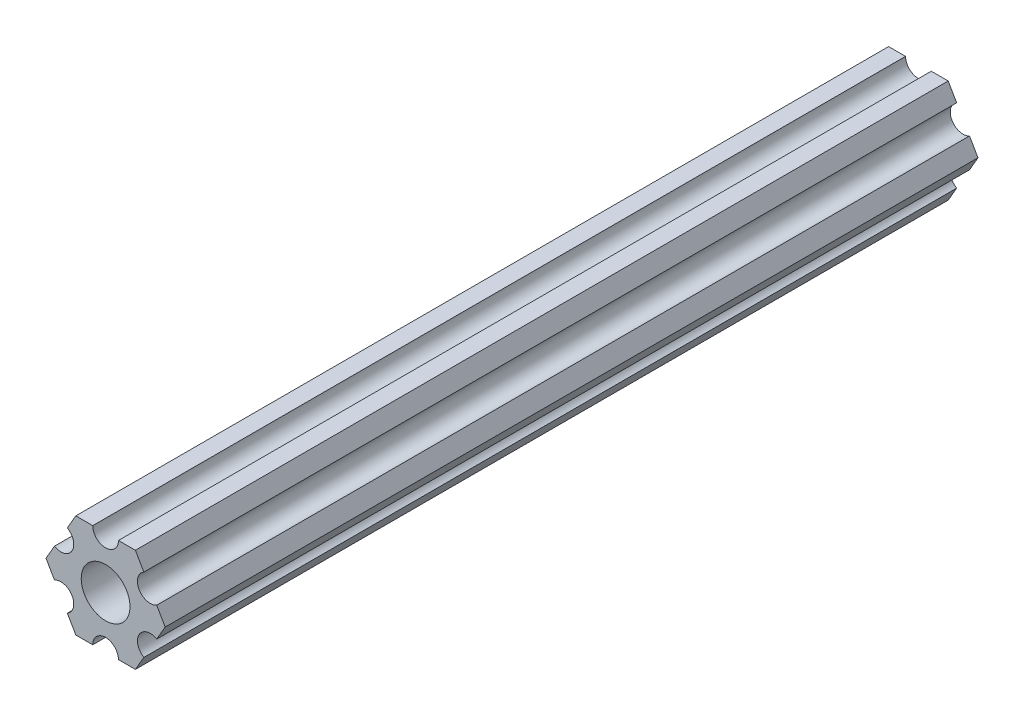
ISO-10303-21;
HEADER;
FILE_DESCRIPTION(('STEP AP214'),'2;1');
FILE_NAME('part.step','',(''),(''),'','','');
FILE_SCHEMA(('AUTOMOTIVE_DESIGN { 1 0 10303 214 1 1 1 1 }'));
ENDSEC;
DATA;
#1=APPLICATION_CONTEXT('core data for automotive mechanical design processes');
#2=APPLICATION_PROTOCOL_DEFINITION('international standard','automotive_design',2000,#1);
#3=PRODUCT_CONTEXT('',#1,'mechanical');
#4=PRODUCT('Part','Part','',(#3));
#5=PRODUCT_RELATED_PRODUCT_CATEGORY('part','',(#4));
#6=PRODUCT_DEFINITION_FORMATION('','',#4);
#7=PRODUCT_DEFINITION_CONTEXT('part definition',#1,'design');
#8=PRODUCT_DEFINITION('design','',#6,#7);
#9=PRODUCT_DEFINITION_SHAPE('','',#8);
#10=(LENGTH_UNIT() NAMED_UNIT(*) SI_UNIT(.MILLI.,.METRE.));
#11=(NAMED_UNIT(*) PLANE_ANGLE_UNIT() SI_UNIT($,.RADIAN.));
#12=(NAMED_UNIT(*) SI_UNIT($,.STERADIAN.) SOLID_ANGLE_UNIT());
#13=UNCERTAINTY_MEASURE_WITH_UNIT(LENGTH_MEASURE(1.E-05),#10,'distance_accuracy_value','');
#14=(GEOMETRIC_REPRESENTATION_CONTEXT(3) GLOBAL_UNCERTAINTY_ASSIGNED_CONTEXT((#13)) GLOBAL_UNIT_ASSIGNED_CONTEXT((#10,
#11,#12)) REPRESENTATION_CONTEXT('',''));
#15=CARTESIAN_POINT('',(0.,0.,0.));
#16=DIRECTION('',(0.,0.,1.));
#17=DIRECTION('',(1.,0.,0.));
#18=AXIS2_PLACEMENT_3D('',#15,#16,#17);
#19=CARTESIAN_POINT('',(7.3323484187082,0.,100.));
#20=DIRECTION('',(0.866025434075722,-0.499999947533954,0.));
#21=DIRECTION('',(0.499999947533954,0.866025434075722,0.));
#22=AXIS2_PLACEMENT_3D('',#19,#20,#21);
#23=PLANE('',#22);
#24=DIRECTION('',(-0.499999947533954,-0.866025434075722,0.));
#25=VECTOR('',#24,1.);
#26=CARTESIAN_POINT('',(7.3323484187082,0.,0.));
#27=LINE('',#26,#25);
#28=CARTESIAN_POINT('',(7.3323484187082,0.,0.));
#29=VERTEX_POINT('',#28);
#30=CARTESIAN_POINT('',(6.28987187503631,-1.80562259196218,0.));
#31=VERTEX_POINT('',#30);
#32=EDGE_CURVE('E197',#29,#31,#27,.T.);
#33=ORIENTED_EDGE('',*,*,#32,.F.);
#34=DIRECTION('',(0.,0.,-1.));
#35=VECTOR('',#34,1.);
#36=CARTESIAN_POINT('',(7.3323484187082,0.,100.));
#37=LINE('',#36,#35);
#38=CARTESIAN_POINT('',(7.3323484187082,0.,100.));
#39=VERTEX_POINT('',#38);
#40=EDGE_CURVE('E11',#39,#29,#37,.T.);
#41=ORIENTED_EDGE('',*,*,#40,.F.);
#42=DIRECTION('',(-0.499999947533954,-0.866025434075722,0.));
#43=VECTOR('',#42,1.);
#44=CARTESIAN_POINT('',(7.3323484187082,0.,100.));
#45=LINE('',#44,#43);
#46=CARTESIAN_POINT('',(6.28987187503631,-1.80562259196218,100.));
#47=VERTEX_POINT('',#46);
#48=EDGE_CURVE('E248',#39,#47,#45,.T.);
#49=ORIENTED_EDGE('',*,*,#48,.T.);
#50=DIRECTION('',(0.,0.,-1.));
#51=VECTOR('',#50,1.);
#52=CARTESIAN_POINT('',(6.28987187503631,-1.80562259196218,100.));
#53=LINE('',#52,#51);
#54=EDGE_CURVE('E43',#47,#31,#53,.T.);
#55=ORIENTED_EDGE('',*,*,#54,.T.);
#56=EDGE_LOOP('',(#33,#41,#49,#55));
#57=FACE_BOUND('',#56,.T.);
#58=ADVANCED_FACE('F40',(#57),#23,.T.);
#59=CARTESIAN_POINT('',(6.28987127155853,1.80562313196892,100.));
#60=DIRECTION('',(0.866025373493151,0.500000052466046,0.));
#61=DIRECTION('',(-0.500000052466046,0.866025373493151,0.));
#62=AXIS2_PLACEMENT_3D('',#59,#60,#61);
#63=PLANE('',#62);
#64=DIRECTION('',(0.500000052466046,-0.866025373493151,0.));
#65=VECTOR('',#64,1.);
#66=CARTESIAN_POINT('',(6.28987127155853,1.80562313196892,0.));
#67=LINE('',#66,#65);
#68=CARTESIAN_POINT('',(6.28987127155855,1.80562313196887,0.));
#69=VERTEX_POINT('',#68);
#70=EDGE_CURVE('E246',#69,#29,#67,.T.);
#71=ORIENTED_EDGE('',*,*,#70,.F.);
#72=DIRECTION('',(0.,0.,-1.));
#73=VECTOR('',#72,1.);
#74=CARTESIAN_POINT('',(6.28987127155855,1.80562313196887,100.));
#75=LINE('',#74,#73);
#76=CARTESIAN_POINT('',(6.28987127155855,1.80562313196887,100.));
#77=VERTEX_POINT('',#76);
#78=EDGE_CURVE('E49',#77,#69,#75,.T.);
#79=ORIENTED_EDGE('',*,*,#78,.F.);
#80=DIRECTION('',(0.500000052466046,-0.866025373493151,0.));
#81=VECTOR('',#80,1.);
#82=CARTESIAN_POINT('',(6.28987127155853,1.80562313196892,100.));
#83=LINE('',#82,#81);
#84=EDGE_CURVE('E187',#77,#39,#83,.T.);
#85=ORIENTED_EDGE('',*,*,#84,.T.);
#86=ORIENTED_EDGE('',*,*,#40,.T.);
#87=EDGE_LOOP('',(#71,#79,#85,#86));
#88=FACE_BOUND('',#87,.T.);
#89=ADVANCED_FACE('F280',(#88),#63,.T.);
#90=CARTESIAN_POINT('',(5.49926112168159,3.17500033315928,100.));
#91=DIRECTION('',(0.,0.,-1.));
#92=DIRECTION('',(-1.,0.,0.));
#93=AXIS2_PLACEMENT_3D('',#90,#91,#92);
#94=CYLINDRICAL_SURFACE('',#93,1.58122051853262);
#95=CARTESIAN_POINT('',(5.49926112168159,3.17500033315928,0.));
#96=DIRECTION('',(0.,0.,1.));
#97=DIRECTION('',(1.,0.,0.));
#98=AXIS2_PLACEMENT_3D('',#95,#96,#97);
#99=CIRCLE('',#98,1.58122051853262);
#100=CARTESIAN_POINT('',(4.70865058710515,4.54437731224338,0.));
#101=VERTEX_POINT('',#100);
#102=EDGE_CURVE('E174',#101,#69,#99,.T.);
#103=ORIENTED_EDGE('',*,*,#102,.F.);
#104=DIRECTION('',(0.,0.,-1.));
#105=VECTOR('',#104,1.);
#106=CARTESIAN_POINT('',(4.70865058710515,4.54437731224338,100.));
#107=LINE('',#106,#105);
#108=CARTESIAN_POINT('',(4.70865058710515,4.54437731224338,100.));
#109=VERTEX_POINT('',#108);
#110=EDGE_CURVE('E169',#109,#101,#107,.T.);
#111=ORIENTED_EDGE('',*,*,#110,.F.);
#112=CARTESIAN_POINT('',(5.49926112168159,3.17500033315928,100.));
#113=DIRECTION('',(0.,0.,1.));
#114=DIRECTION('',(1.,0.,0.));
#115=AXIS2_PLACEMENT_3D('',#112,#113,#114);
#116=CIRCLE('',#115,1.58122051853262);
#117=EDGE_CURVE('E172',#109,#77,#116,.T.);
#118=ORIENTED_EDGE('',*,*,#117,.T.);
#119=ORIENTED_EDGE('',*,*,#78,.T.);
#120=EDGE_LOOP('',(#103,#111,#118,#119));
#121=FACE_BOUND('',#120,.T.);
#122=ADVANCED_FACE('F171',(#121),#94,.F.);
#123=CARTESIAN_POINT('',(3.66617382465476,6.3499997778937,100.));
#124=DIRECTION('',(0.866025373493151,0.500000052466046,0.));
#125=DIRECTION('',(-0.500000052466046,0.866025373493151,0.));
#126=AXIS2_PLACEMENT_3D('',#123,#124,#125);
#127=PLANE('',#126);
#128=DIRECTION('',(0.500000052466046,-0.866025373493151,0.));
#129=VECTOR('',#128,1.);
#130=CARTESIAN_POINT('',(3.66617382465476,6.3499997778937,0.));
#131=LINE('',#130,#129);
#132=CARTESIAN_POINT('',(3.66617382465476,6.3499997778937,0.));
#133=VERTEX_POINT('',#132);
#134=EDGE_CURVE('E243',#133,#101,#131,.T.);
#135=ORIENTED_EDGE('',*,*,#134,.F.);
#136=DIRECTION('',(0.,0.,-1.));
#137=VECTOR('',#136,1.);
#138=CARTESIAN_POINT('',(3.66617382465476,6.3499997778937,100.));
#139=LINE('',#138,#137);
#140=CARTESIAN_POINT('',(3.66617382465476,6.3499997778937,100.));
#141=VERTEX_POINT('',#140);
#142=EDGE_CURVE('E179',#141,#133,#139,.T.);
#143=ORIENTED_EDGE('',*,*,#142,.F.);
#144=DIRECTION('',(0.500000052466046,-0.866025373493151,0.));
#145=VECTOR('',#144,1.);
#146=CARTESIAN_POINT('',(3.66617382465476,6.3499997778937,100.));
#147=LINE('',#146,#145);
#148=EDGE_CURVE('E185',#141,#109,#147,.T.);
#149=ORIENTED_EDGE('',*,*,#148,.T.);
#150=ORIENTED_EDGE('',*,*,#110,.T.);
#151=EDGE_LOOP('',(#135,#143,#149,#150));
#152=FACE_BOUND('',#151,.T.);
#153=ADVANCED_FACE('F189',(#152),#127,.T.);
#154=CARTESIAN_POINT('',(1.58122013383337,6.3499997778937,100.));
#155=DIRECTION('',(0.,1.,0.));
#156=DIRECTION('',(-1.,0.,0.));
#157=AXIS2_PLACEMENT_3D('',#154,#155,#156);
#158=PLANE('',#157);
#159=DIRECTION('',(1.,0.,0.));
#160=VECTOR('',#159,1.);
#161=CARTESIAN_POINT('',(1.58122013383337,6.3499997778937,0.));
#162=LINE('',#161,#160);
#163=CARTESIAN_POINT('',(1.58122013383338,6.3499997778937,0.));
#164=VERTEX_POINT('',#163);
#165=EDGE_CURVE('E240',#164,#133,#162,.T.);
#166=ORIENTED_EDGE('',*,*,#165,.F.);
#167=DIRECTION('',(0.,0.,-1.));
#168=VECTOR('',#167,1.);
#169=CARTESIAN_POINT('',(1.58122013383338,6.3499997778937,100.));
#170=LINE('',#169,#168);
#171=CARTESIAN_POINT('',(1.58122013383338,6.3499997778937,100.));
#172=VERTEX_POINT('',#171);
#173=EDGE_CURVE('E252',#172,#164,#170,.T.);
#174=ORIENTED_EDGE('',*,*,#173,.F.);
#175=DIRECTION('',(1.,0.,0.));
#176=VECTOR('',#175,1.);
#177=CARTESIAN_POINT('',(1.58122013383337,6.3499997778937,100.));
#178=LINE('',#177,#176);
#179=EDGE_CURVE('E190',#172,#141,#178,.T.);
#180=ORIENTED_EDGE('',*,*,#179,.T.);
#181=ORIENTED_EDGE('',*,*,#142,.T.);
#182=EDGE_LOOP('',(#166,#174,#180,#181));
#183=FACE_BOUND('',#182,.T.);
#184=ADVANCED_FACE('F293',(#183),#158,.T.);
#185=CARTESIAN_POINT('',(-3.84699217701617E-07,6.35,100.));
#186=DIRECTION('',(0.,0.,-1.));
#187=DIRECTION('',(-1.,0.,0.));
#188=AXIS2_PLACEMENT_3D('',#185,#186,#187);
#189=CYLINDRICAL_SURFACE('',#188,1.58122051853262);
#190=CARTESIAN_POINT('',(-3.84699217701617E-07,6.35,0.));
#191=DIRECTION('',(0.,0.,1.));
#192=DIRECTION('',(1.,0.,0.));
#193=AXIS2_PLACEMENT_3D('',#190,#191,#192);
#194=CIRCLE('',#193,1.58122051853262);
#195=CARTESIAN_POINT('',(-1.58122090323183,6.3499997778937,0.));
#196=VERTEX_POINT('',#195);
#197=EDGE_CURVE('E237',#196,#164,#194,.T.);
#198=ORIENTED_EDGE('',*,*,#197,.F.);
#199=DIRECTION('',(0.,0.,-1.));
#200=VECTOR('',#199,1.);
#201=CARTESIAN_POINT('',(-1.58122090323183,6.3499997778937,100.));
#202=LINE('',#201,#200);
#203=CARTESIAN_POINT('',(-1.58122090323183,6.3499997778937,100.));
#204=VERTEX_POINT('',#203);
#205=EDGE_CURVE('E254',#204,#196,#202,.T.);
#206=ORIENTED_EDGE('',*,*,#205,.F.);
#207=CARTESIAN_POINT('',(-3.84699217701617E-07,6.35,100.));
#208=DIRECTION('',(0.,0.,1.));
#209=DIRECTION('',(1.,0.,0.));
#210=AXIS2_PLACEMENT_3D('',#207,#208,#209);
#211=CIRCLE('',#210,1.58122051853262);
#212=EDGE_CURVE('E192',#204,#172,#211,.T.);
#213=ORIENTED_EDGE('',*,*,#212,.T.);
#214=ORIENTED_EDGE('',*,*,#173,.T.);
#215=EDGE_LOOP('',(#198,#206,#213,#214));
#216=FACE_BOUND('',#215,.T.);
#217=ADVANCED_FACE('F296',(#216),#189,.F.);
#218=CARTESIAN_POINT('',(-3.66617459405349,6.3499997778937,100.));
#219=DIRECTION('',(0.,1.,0.));
#220=DIRECTION('',(0.,0.,1.));
#221=AXIS2_PLACEMENT_3D('',#218,#219,#220);
#222=PLANE('',#221);
#223=DIRECTION('',(1.,0.,0.));
#224=VECTOR('',#223,1.);
#225=CARTESIAN_POINT('',(-3.66617459405349,6.3499997778937,0.));
#226=LINE('',#225,#224);
#227=CARTESIAN_POINT('',(-3.66617459405349,6.3499997778937,0.));
#228=VERTEX_POINT('',#227);
#229=EDGE_CURVE('E234',#228,#196,#226,.T.);
#230=ORIENTED_EDGE('',*,*,#229,.F.);
#231=DIRECTION('',(0.,0.,-1.));
#232=VECTOR('',#231,1.);
#233=CARTESIAN_POINT('',(-3.66617459405349,6.3499997778937,100.));
#234=LINE('',#233,#232);
#235=CARTESIAN_POINT('',(-3.66617459405349,6.3499997778937,100.));
#236=VERTEX_POINT('',#235);
#237=EDGE_CURVE('E256',#236,#228,#234,.T.);
#238=ORIENTED_EDGE('',*,*,#237,.F.);
#239=DIRECTION('',(1.,0.,0.));
#240=VECTOR('',#239,1.);
#241=CARTESIAN_POINT('',(-3.66617459405349,6.3499997778937,100.));
#242=LINE('',#241,#240);
#243=EDGE_CURVE('E401',#236,#204,#242,.T.);
#244=ORIENTED_EDGE('',*,*,#243,.T.);
#245=ORIENTED_EDGE('',*,*,#205,.T.);
#246=EDGE_LOOP('',(#230,#238,#244,#245));
#247=FACE_BOUND('',#246,.T.);
#248=ADVANCED_FACE('F300',(#247),#222,.T.);
#249=CARTESIAN_POINT('',(-4.70865133007489,4.54437685277235,100.));
#250=DIRECTION('',(-0.866025434075722,0.499999947533955,0.));
#251=DIRECTION('',(-0.499999947533955,-0.866025434075722,0.));
#252=AXIS2_PLACEMENT_3D('',#249,#250,#251);
#253=PLANE('',#252);
#254=DIRECTION('',(0.499999947533955,0.866025434075722,0.));
#255=VECTOR('',#254,1.);
#256=CARTESIAN_POINT('',(-4.70865133007489,4.54437685277235,0.));
#257=LINE('',#256,#255);
#258=CARTESIAN_POINT('',(-4.70865133007489,4.54437685277235,0.));
#259=VERTEX_POINT('',#258);
#260=EDGE_CURVE('E231',#259,#228,#257,.T.);
#261=ORIENTED_EDGE('',*,*,#260,.F.);
#262=DIRECTION('',(0.,0.,-1.));
#263=VECTOR('',#262,1.);
#264=CARTESIAN_POINT('',(-4.70865133007489,4.54437685277235,100.));
#265=LINE('',#264,#263);
#266=CARTESIAN_POINT('',(-4.70865133007489,4.54437685277235,100.));
#267=VERTEX_POINT('',#266);
#268=EDGE_CURVE('E258',#267,#259,#265,.T.);
#269=ORIENTED_EDGE('',*,*,#268,.F.);
#270=DIRECTION('',(0.499999947533955,0.866025434075722,0.));
#271=VECTOR('',#270,1.);
#272=CARTESIAN_POINT('',(-4.70865133007489,4.54437685277235,100.));
#273=LINE('',#272,#271);
#274=EDGE_CURVE('E398',#267,#236,#273,.T.);
#275=ORIENTED_EDGE('',*,*,#274,.T.);
#276=ORIENTED_EDGE('',*,*,#237,.T.);
#277=EDGE_LOOP('',(#261,#269,#275,#276));
#278=FACE_BOUND('',#277,.T.);
#279=ADVANCED_FACE('F304',(#278),#253,.T.);
#280=CARTESIAN_POINT('',(-5.4992615063808,3.17499966684069,100.));
#281=DIRECTION('',(0.,0.,-1.));
#282=DIRECTION('',(-1.,0.,0.));
#283=AXIS2_PLACEMENT_3D('',#280,#281,#282);
#284=CYLINDRICAL_SURFACE('',#283,1.58122051853262);
#285=CARTESIAN_POINT('',(-5.4992615063808,3.17499966684069,0.));
#286=DIRECTION('',(0.,0.,1.));
#287=DIRECTION('',(1.,0.,0.));
#288=AXIS2_PLACEMENT_3D('',#285,#286,#287);
#289=CIRCLE('',#288,1.58122051853262);
#290=CARTESIAN_POINT('',(-6.28987168268674,1.80562248090905,0.));
#291=VERTEX_POINT('',#290);
#292=EDGE_CURVE('E228',#291,#259,#289,.T.);
#293=ORIENTED_EDGE('',*,*,#292,.F.);
#294=DIRECTION('',(0.,0.,-1.));
#295=VECTOR('',#294,1.);
#296=CARTESIAN_POINT('',(-6.28987168268674,1.80562248090905,100.));
#297=LINE('',#296,#295);
#298=CARTESIAN_POINT('',(-6.28987168268674,1.80562248090905,100.));
#299=VERTEX_POINT('',#298);
#300=EDGE_CURVE('E260',#299,#291,#297,.T.);
#301=ORIENTED_EDGE('',*,*,#300,.F.);
#302=CARTESIAN_POINT('',(-5.4992615063808,3.17499966684069,100.));
#303=DIRECTION('',(0.,0.,1.));
#304=DIRECTION('',(1.,0.,0.));
#305=AXIS2_PLACEMENT_3D('',#302,#303,#304);
#306=CIRCLE('',#305,1.58122051853262);
#307=EDGE_CURVE('E395',#299,#267,#306,.T.);
#308=ORIENTED_EDGE('',*,*,#307,.T.);
#309=ORIENTED_EDGE('',*,*,#268,.T.);
#310=EDGE_LOOP('',(#293,#301,#308,#309));
#311=FACE_BOUND('',#310,.T.);
#312=ADVANCED_FACE('F308',(#311),#284,.F.);
#313=CARTESIAN_POINT('',(-7.33234841870827,-4.44212523790841E-07,100.));
#314=DIRECTION('',(-0.866025434075722,0.499999947533954,0.));
#315=DIRECTION('',(-0.499999947533954,-0.866025434075722,0.));
#316=AXIS2_PLACEMENT_3D('',#313,#314,#315);
#317=PLANE('',#316);
#318=DIRECTION('',(0.499999947533954,0.866025434075722,0.));
#319=VECTOR('',#318,1.);
#320=CARTESIAN_POINT('',(-7.33234841870827,-4.44212523790841E-07,0.));
#321=LINE('',#320,#319);
#322=CARTESIAN_POINT('',(-7.33234841870827,-4.44212523790841E-07,0.));
#323=VERTEX_POINT('',#322);
#324=EDGE_CURVE('E225',#323,#291,#321,.T.);
#325=ORIENTED_EDGE('',*,*,#324,.F.);
#326=DIRECTION('',(0.,0.,-1.));
#327=VECTOR('',#326,1.);
#328=CARTESIAN_POINT('',(-7.33234841870827,-4.44212523790841E-07,100.));
#329=LINE('',#328,#327);
#330=CARTESIAN_POINT('',(-7.33234841870827,-4.44212523790841E-07,100.));
#331=VERTEX_POINT('',#330);
#332=EDGE_CURVE('E262',#331,#323,#329,.T.);
#333=ORIENTED_EDGE('',*,*,#332,.F.);
#334=DIRECTION('',(0.499999947533954,0.866025434075722,0.));
#335=VECTOR('',#334,1.);
#336=CARTESIAN_POINT('',(-7.33234841870827,-4.44212523790841E-07,100.));
#337=LINE('',#336,#335);
#338=EDGE_CURVE('E392',#331,#299,#337,.T.);
#339=ORIENTED_EDGE('',*,*,#338,.T.);
#340=ORIENTED_EDGE('',*,*,#300,.T.);
#341=EDGE_LOOP('',(#325,#333,#339,#340));
#342=FACE_BOUND('',#341,.T.);
#343=ADVANCED_FACE('F312',(#342),#317,.T.);
#344=CARTESIAN_POINT('',(-6.28987146390827,-1.80562324302209,100.));
#345=DIRECTION('',(-0.866025373493151,-0.500000052466045,0.));
#346=DIRECTION('',(0.500000052466045,-0.866025373493151,0.));
#347=AXIS2_PLACEMENT_3D('',#344,#345,#346);
#348=PLANE('',#347);
#349=DIRECTION('',(-0.500000052466045,0.866025373493151,0.));
#350=VECTOR('',#349,1.);
#351=CARTESIAN_POINT('',(-6.28987146390827,-1.80562324302209,0.));
#352=LINE('',#351,#350);
#353=CARTESIAN_POINT('',(-6.28987146390827,-1.80562324302209,0.));
#354=VERTEX_POINT('',#353);
#355=EDGE_CURVE('E222',#354,#323,#352,.T.);
#356=ORIENTED_EDGE('',*,*,#355,.F.);
#357=DIRECTION('',(0.,0.,-1.));
#358=VECTOR('',#357,1.);
#359=CARTESIAN_POINT('',(-6.28987146390827,-1.80562324302209,100.));
#360=LINE('',#359,#358);
#361=CARTESIAN_POINT('',(-6.28987146390827,-1.80562324302209,100.));
#362=VERTEX_POINT('',#361);
#363=EDGE_CURVE('E264',#362,#354,#360,.T.);
#364=ORIENTED_EDGE('',*,*,#363,.F.);
#365=DIRECTION('',(-0.500000052466045,0.866025373493151,0.));
#366=VECTOR('',#365,1.);
#367=CARTESIAN_POINT('',(-6.28987146390827,-1.80562324302209,100.));
#368=LINE('',#367,#366);
#369=EDGE_CURVE('E389',#362,#331,#368,.T.);
#370=ORIENTED_EDGE('',*,*,#369,.T.);
#371=ORIENTED_EDGE('',*,*,#332,.T.);
#372=EDGE_LOOP('',(#356,#364,#370,#371));
#373=FACE_BOUND('',#372,.T.);
#374=ADVANCED_FACE('F316',(#373),#348,.T.);
#375=CARTESIAN_POINT('',(-5.49926112168156,-3.17500033315932,100.));
#376=DIRECTION('',(0.,0.,-1.));
#377=DIRECTION('',(-1.,0.,0.));
#378=AXIS2_PLACEMENT_3D('',#375,#376,#377);
#379=CYLINDRICAL_SURFACE('',#378,1.58122051853262);
#380=CARTESIAN_POINT('',(-5.49926112168156,-3.17500033315932,0.));
#381=DIRECTION('',(0.,0.,1.));
#382=DIRECTION('',(1.,0.,0.));
#383=AXIS2_PLACEMENT_3D('',#380,#381,#382);
#384=CIRCLE('',#383,1.58122051853262);
#385=CARTESIAN_POINT('',(-4.70865077945488,-4.54437742329658,0.));
#386=VERTEX_POINT('',#385);
#387=EDGE_CURVE('E219',#386,#354,#384,.T.);
#388=ORIENTED_EDGE('',*,*,#387,.F.);
#389=DIRECTION('',(0.,0.,-1.));
#390=VECTOR('',#389,1.);
#391=CARTESIAN_POINT('',(-4.70865077945488,-4.54437742329658,100.));
#392=LINE('',#391,#390);
#393=CARTESIAN_POINT('',(-4.70865077945488,-4.54437742329658,100.));
#394=VERTEX_POINT('',#393);
#395=EDGE_CURVE('E266',#394,#386,#392,.T.);
#396=ORIENTED_EDGE('',*,*,#395,.F.);
#397=CARTESIAN_POINT('',(-5.49926112168156,-3.17500033315932,100.));
#398=DIRECTION('',(0.,0.,1.));
#399=DIRECTION('',(1.,0.,0.));
#400=AXIS2_PLACEMENT_3D('',#397,#398,#399);
#401=CIRCLE('',#400,1.58122051853262);
#402=EDGE_CURVE('E386',#394,#362,#401,.T.);
#403=ORIENTED_EDGE('',*,*,#402,.T.);
#404=ORIENTED_EDGE('',*,*,#363,.T.);
#405=EDGE_LOOP('',(#388,#396,#403,#404));
#406=FACE_BOUND('',#405,.T.);
#407=ADVANCED_FACE('F320',(#406),#379,.F.);
#408=CARTESIAN_POINT('',(-3.66617382465481,-6.35000022210628,100.));
#409=DIRECTION('',(-0.866025373493151,-0.500000052466046,0.));
#410=DIRECTION('',(0.500000052466046,-0.866025373493151,0.));
#411=AXIS2_PLACEMENT_3D('',#408,#409,#410);
#412=PLANE('',#411);
#413=DIRECTION('',(-0.500000052466046,0.866025373493151,0.));
#414=VECTOR('',#413,1.);
#415=CARTESIAN_POINT('',(-3.66617382465481,-6.35000022210628,0.));
#416=LINE('',#415,#414);
#417=CARTESIAN_POINT('',(-3.66617382465481,-6.35000022210628,0.));
#418=VERTEX_POINT('',#417);
#419=EDGE_CURVE('E216',#418,#386,#416,.T.);
#420=ORIENTED_EDGE('',*,*,#419,.F.);
#421=DIRECTION('',(0.,0.,-1.));
#422=VECTOR('',#421,1.);
#423=CARTESIAN_POINT('',(-3.66617382465481,-6.35000022210628,100.));
#424=LINE('',#423,#422);
#425=CARTESIAN_POINT('',(-3.66617382465481,-6.35000022210628,100.));
#426=VERTEX_POINT('',#425);
#427=EDGE_CURVE('E268',#426,#418,#424,.T.);
#428=ORIENTED_EDGE('',*,*,#427,.F.);
#429=DIRECTION('',(-0.500000052466046,0.866025373493151,0.));
#430=VECTOR('',#429,1.);
#431=CARTESIAN_POINT('',(-3.66617382465481,-6.35000022210628,100.));
#432=LINE('',#431,#430);
#433=EDGE_CURVE('E383',#426,#394,#432,.T.);
#434=ORIENTED_EDGE('',*,*,#433,.T.);
#435=ORIENTED_EDGE('',*,*,#395,.T.);
#436=EDGE_LOOP('',(#420,#428,#434,#435));
#437=FACE_BOUND('',#436,.T.);
#438=ADVANCED_FACE('F324',(#437),#412,.T.);
#439=CARTESIAN_POINT('',(-1.58122013383335,-6.35000022210628,100.));
#440=DIRECTION('',(0.,-1.,0.));
#441=DIRECTION('',(1.,0.,0.));
#442=AXIS2_PLACEMENT_3D('',#439,#440,#441);
#443=PLANE('',#442);
#444=DIRECTION('',(-1.,0.,0.));
#445=VECTOR('',#444,1.);
#446=CARTESIAN_POINT('',(-1.58122013383335,-6.35000022210628,0.));
#447=LINE('',#446,#445);
#448=CARTESIAN_POINT('',(-1.58122013383334,-6.35000022210628,0.));
#449=VERTEX_POINT('',#448);
#450=EDGE_CURVE('E213',#449,#418,#447,.T.);
#451=ORIENTED_EDGE('',*,*,#450,.F.);
#452=DIRECTION('',(0.,0.,-1.));
#453=VECTOR('',#452,1.);
#454=CARTESIAN_POINT('',(-1.58122013383334,-6.35000022210628,100.));
#455=LINE('',#454,#453);
#456=CARTESIAN_POINT('',(-1.58122013383334,-6.35000022210628,100.));
#457=VERTEX_POINT('',#456);
#458=EDGE_CURVE('E270',#457,#449,#455,.T.);
#459=ORIENTED_EDGE('',*,*,#458,.F.);
#460=DIRECTION('',(-1.,0.,0.));
#461=VECTOR('',#460,1.);
#462=CARTESIAN_POINT('',(-1.58122013383335,-6.35000022210628,100.));
#463=LINE('',#462,#461);
#464=EDGE_CURVE('E380',#457,#426,#463,.T.);
#465=ORIENTED_EDGE('',*,*,#464,.T.);
#466=ORIENTED_EDGE('',*,*,#427,.T.);
#467=EDGE_LOOP('',(#451,#459,#465,#466));
#468=FACE_BOUND('',#467,.T.);
#469=ADVANCED_FACE('F328',(#468),#443,.T.);
#470=CARTESIAN_POINT('',(3.8469926204343E-07,-6.35,100.));
#471=DIRECTION('',(0.,0.,-1.));
#472=DIRECTION('',(-1.,0.,0.));
#473=AXIS2_PLACEMENT_3D('',#470,#471,#472);
#474=CYLINDRICAL_SURFACE('',#473,1.58122051853262);
#475=CARTESIAN_POINT('',(3.8469926204343E-07,-6.35,0.));
#476=DIRECTION('',(0.,0.,1.));
#477=DIRECTION('',(1.,0.,0.));
#478=AXIS2_PLACEMENT_3D('',#475,#476,#477);
#479=CIRCLE('',#478,1.58122051853262);
#480=CARTESIAN_POINT('',(1.58122090323185,-6.35000022210628,0.));
#481=VERTEX_POINT('',#480);
#482=EDGE_CURVE('E210',#481,#449,#479,.T.);
#483=ORIENTED_EDGE('',*,*,#482,.F.);
#484=DIRECTION('',(0.,0.,-1.));
#485=VECTOR('',#484,1.);
#486=CARTESIAN_POINT('',(1.58122090323185,-6.35000022210628,100.));
#487=LINE('',#486,#485);
#488=CARTESIAN_POINT('',(1.58122090323185,-6.35000022210628,100.));
#489=VERTEX_POINT('',#488);
#490=EDGE_CURVE('E272',#489,#481,#487,.T.);
#491=ORIENTED_EDGE('',*,*,#490,.F.);
#492=CARTESIAN_POINT('',(3.8469926204343E-07,-6.35,100.));
#493=DIRECTION('',(0.,0.,1.));
#494=DIRECTION('',(1.,0.,0.));
#495=AXIS2_PLACEMENT_3D('',#492,#493,#494);
#496=CIRCLE('',#495,1.58122051853262);
#497=EDGE_CURVE('E377',#489,#457,#496,.T.);
#498=ORIENTED_EDGE('',*,*,#497,.T.);
#499=ORIENTED_EDGE('',*,*,#458,.T.);
#500=EDGE_LOOP('',(#483,#491,#498,#499));
#501=FACE_BOUND('',#500,.T.);
#502=ADVANCED_FACE('F332',(#501),#474,.F.);
#503=CARTESIAN_POINT('',(3.66617459405339,-6.35000022210628,100.));
#504=DIRECTION('',(0.,-1.,0.));
#505=DIRECTION('',(1.,0.,0.));
#506=AXIS2_PLACEMENT_3D('',#503,#504,#505);
#507=PLANE('',#506);
#508=DIRECTION('',(-1.,0.,0.));
#509=VECTOR('',#508,1.);
#510=CARTESIAN_POINT('',(3.66617459405339,-6.35000022210628,0.));
#511=LINE('',#510,#509);
#512=CARTESIAN_POINT('',(3.66617459405339,-6.35000022210628,0.));
#513=VERTEX_POINT('',#512);
#514=EDGE_CURVE('E207',#513,#481,#511,.T.);
#515=ORIENTED_EDGE('',*,*,#514,.F.);
#516=DIRECTION('',(0.,0.,-1.));
#517=VECTOR('',#516,1.);
#518=CARTESIAN_POINT('',(3.66617459405339,-6.35000022210628,100.));
#519=LINE('',#518,#517);
#520=CARTESIAN_POINT('',(3.66617459405339,-6.35000022210628,100.));
#521=VERTEX_POINT('',#520);
#522=EDGE_CURVE('E274',#521,#513,#519,.T.);
#523=ORIENTED_EDGE('',*,*,#522,.F.);
#524=DIRECTION('',(-1.,0.,0.));
#525=VECTOR('',#524,1.);
#526=CARTESIAN_POINT('',(3.66617459405339,-6.35000022210628,100.));
#527=LINE('',#526,#525);
#528=EDGE_CURVE('E374',#521,#489,#527,.T.);
#529=ORIENTED_EDGE('',*,*,#528,.T.);
#530=ORIENTED_EDGE('',*,*,#490,.T.);
#531=EDGE_LOOP('',(#515,#523,#529,#530));
#532=FACE_BOUND('',#531,.T.);
#533=ADVANCED_FACE('F336',(#532),#507,.T.);
#534=CARTESIAN_POINT('',(4.70865152242452,-4.54437696382539,100.));
#535=DIRECTION('',(0.866025434075722,-0.499999947533955,0.));
#536=DIRECTION('',(0.499999947533955,0.866025434075722,0.));
#537=AXIS2_PLACEMENT_3D('',#534,#535,#536);
#538=PLANE('',#537);
#539=DIRECTION('',(-0.499999947533955,-0.866025434075722,0.));
#540=VECTOR('',#539,1.);
#541=CARTESIAN_POINT('',(4.70865152242452,-4.54437696382539,0.));
#542=LINE('',#541,#540);
#543=CARTESIAN_POINT('',(4.70865152242448,-4.54437696382545,0.));
#544=VERTEX_POINT('',#543);
#545=EDGE_CURVE('E204',#544,#513,#542,.T.);
#546=ORIENTED_EDGE('',*,*,#545,.F.);
#547=DIRECTION('',(0.,0.,-1.));
#548=VECTOR('',#547,1.);
#549=CARTESIAN_POINT('',(4.70865152242448,-4.54437696382545,100.));
#550=LINE('',#549,#548);
#551=CARTESIAN_POINT('',(4.70865152242448,-4.54437696382545,100.));
#552=VERTEX_POINT('',#551);
#553=EDGE_CURVE('E275',#552,#544,#550,.T.);
#554=ORIENTED_EDGE('',*,*,#553,.F.);
#555=DIRECTION('',(-0.499999947533955,-0.866025434075722,0.));
#556=VECTOR('',#555,1.);
#557=CARTESIAN_POINT('',(4.70865152242452,-4.54437696382539,100.));
#558=LINE('',#557,#556);
#559=EDGE_CURVE('E371',#552,#521,#558,.T.);
#560=ORIENTED_EDGE('',*,*,#559,.T.);
#561=ORIENTED_EDGE('',*,*,#522,.T.);
#562=EDGE_LOOP('',(#546,#554,#560,#561));
#563=FACE_BOUND('',#562,.T.);
#564=ADVANCED_FACE('F340',(#563),#538,.T.);
#565=CARTESIAN_POINT('',(5.49926150638078,-3.17499966684073,100.));
#566=DIRECTION('',(0.,0.,-1.));
#567=DIRECTION('',(-1.,0.,0.));
#568=AXIS2_PLACEMENT_3D('',#565,#566,#567);
#569=CYLINDRICAL_SURFACE('',#568,1.58122051853262);
#570=CARTESIAN_POINT('',(5.49926150638078,-3.17499966684073,0.));
#571=DIRECTION('',(0.,0.,1.));
#572=DIRECTION('',(1.,0.,0.));
#573=AXIS2_PLACEMENT_3D('',#570,#571,#572);
#574=CIRCLE('',#573,1.58122051853262);
#575=EDGE_CURVE('E200',#31,#544,#574,.T.);
#576=ORIENTED_EDGE('',*,*,#575,.F.);
#577=ORIENTED_EDGE('',*,*,#54,.F.);
#578=CARTESIAN_POINT('',(5.49926150638078,-3.17499966684073,100.));
#579=DIRECTION('',(0.,0.,1.));
#580=DIRECTION('',(1.,0.,0.));
#581=AXIS2_PLACEMENT_3D('',#578,#579,#580);
#582=CIRCLE('',#581,1.58122051853262);
#583=EDGE_CURVE('E369',#47,#552,#582,.T.);
#584=ORIENTED_EDGE('',*,*,#583,.T.);
#585=ORIENTED_EDGE('',*,*,#553,.T.);
#586=EDGE_LOOP('',(#576,#577,#584,#585));
#587=FACE_BOUND('',#586,.T.);
#588=ADVANCED_FACE('F277',(#587),#569,.F.);
#589=CARTESIAN_POINT('',(5.49926150638078,-3.17499966684073,100.));
#590=DIRECTION('',(0.,0.,1.));
#591=DIRECTION('',(1.,0.,0.));
#592=AXIS2_PLACEMENT_3D('',#589,#590,#591);
#593=PLANE('',#592);
#594=CARTESIAN_POINT('',(0.,0.,100.));
#595=DIRECTION('',(0.,0.,-1.));
#596=DIRECTION('',(-1.,0.,0.));
#597=AXIS2_PLACEMENT_3D('',#594,#595,#596);
#598=CIRCLE('',#597,3.);
#599=CARTESIAN_POINT('',(-3.,0.,100.));
#600=VERTEX_POINT('',#599);
#601=EDGE_CURVE('E201',#600,#600,#598,.T.);
#602=ORIENTED_EDGE('',*,*,#601,.T.);
#603=EDGE_LOOP('',(#602));
#604=FACE_BOUND('',#603,.T.);
#605=ORIENTED_EDGE('',*,*,#48,.F.);
#606=ORIENTED_EDGE('',*,*,#84,.F.);
#607=ORIENTED_EDGE('',*,*,#117,.F.);
#608=ORIENTED_EDGE('',*,*,#148,.F.);
#609=ORIENTED_EDGE('',*,*,#179,.F.);
#610=ORIENTED_EDGE('',*,*,#212,.F.);
#611=ORIENTED_EDGE('',*,*,#243,.F.);
#612=ORIENTED_EDGE('',*,*,#274,.F.);
#613=ORIENTED_EDGE('',*,*,#307,.F.);
#614=ORIENTED_EDGE('',*,*,#338,.F.);
#615=ORIENTED_EDGE('',*,*,#369,.F.);
#616=ORIENTED_EDGE('',*,*,#402,.F.);
#617=ORIENTED_EDGE('',*,*,#433,.F.);
#618=ORIENTED_EDGE('',*,*,#464,.F.);
#619=ORIENTED_EDGE('',*,*,#497,.F.);
#620=ORIENTED_EDGE('',*,*,#528,.F.);
#621=ORIENTED_EDGE('',*,*,#559,.F.);
#622=ORIENTED_EDGE('',*,*,#583,.F.);
#623=EDGE_LOOP('',(#605,#606,#607,#608,#609,#610,#611,#612,#613,#614,#615,#616,#617,#618,#619,
#620,#621,#622));
#624=FACE_BOUND('',#623,.T.);
#625=ADVANCED_FACE('F183',(#604,#624),#593,.T.);
#626=CARTESIAN_POINT('',(5.49926150638078,-3.17499966684073,0.));
#627=DIRECTION('',(0.,0.,1.));
#628=DIRECTION('',(1.,0.,0.));
#629=AXIS2_PLACEMENT_3D('',#626,#627,#628);
#630=PLANE('',#629);
#631=CARTESIAN_POINT('',(0.,0.,0.));
#632=DIRECTION('',(0.,0.,-1.));
#633=DIRECTION('',(-1.,0.,0.));
#634=AXIS2_PLACEMENT_3D('',#631,#632,#633);
#635=CIRCLE('',#634,3.);
#636=CARTESIAN_POINT('',(-3.,0.,0.));
#637=VERTEX_POINT('',#636);
#638=EDGE_CURVE('E364',#637,#637,#635,.T.);
#639=ORIENTED_EDGE('',*,*,#638,.F.);
#640=EDGE_LOOP('',(#639));
#641=FACE_BOUND('',#640,.T.);
#642=ORIENTED_EDGE('',*,*,#32,.T.);
#643=ORIENTED_EDGE('',*,*,#575,.T.);
#644=ORIENTED_EDGE('',*,*,#545,.T.);
#645=ORIENTED_EDGE('',*,*,#514,.T.);
#646=ORIENTED_EDGE('',*,*,#482,.T.);
#647=ORIENTED_EDGE('',*,*,#450,.T.);
#648=ORIENTED_EDGE('',*,*,#419,.T.);
#649=ORIENTED_EDGE('',*,*,#387,.T.);
#650=ORIENTED_EDGE('',*,*,#355,.T.);
#651=ORIENTED_EDGE('',*,*,#324,.T.);
#652=ORIENTED_EDGE('',*,*,#292,.T.);
#653=ORIENTED_EDGE('',*,*,#260,.T.);
#654=ORIENTED_EDGE('',*,*,#229,.T.);
#655=ORIENTED_EDGE('',*,*,#197,.T.);
#656=ORIENTED_EDGE('',*,*,#165,.T.);
#657=ORIENTED_EDGE('',*,*,#134,.T.);
#658=ORIENTED_EDGE('',*,*,#102,.T.);
#659=ORIENTED_EDGE('',*,*,#70,.T.);
#660=EDGE_LOOP('',(#642,#643,#644,#645,#646,#647,#648,#649,#650,#651,#652,#653,#654,#655,#656,
#657,#658,#659));
#661=FACE_BOUND('',#660,.T.);
#662=ADVANCED_FACE('F279',(#641,#661),#630,.F.);
#663=CARTESIAN_POINT('',(0.,0.,100.));
#664=DIRECTION('',(0.,0.,-1.));
#665=DIRECTION('',(-1.,0.,0.));
#666=AXIS2_PLACEMENT_3D('',#663,#664,#665);
#667=CYLINDRICAL_SURFACE('',#666,3.);
#668=ORIENTED_EDGE('',*,*,#601,.F.);
#669=EDGE_LOOP('',(#668));
#670=FACE_BOUND('',#669,.T.);
#671=ORIENTED_EDGE('',*,*,#638,.T.);
#672=EDGE_LOOP('',(#671));
#673=FACE_BOUND('',#672,.T.);
#674=ADVANCED_FACE('F352',(#670,#673),#667,.F.);
#675=CLOSED_SHELL('',(#58,#89,#122,#153,#184,#217,#248,#279,#312,#343,#374,#407,#438,#469,#502,
#533,#564,#588,#625,#662,#674));
#676=MANIFOLD_SOLID_BREP('B2',#675);
#677=ADVANCED_BREP_SHAPE_REPRESENTATION('',(#18,#676),#14);
#678=SHAPE_DEFINITION_REPRESENTATION(#9,#677);
ENDSEC;
END-ISO-10303-21;
